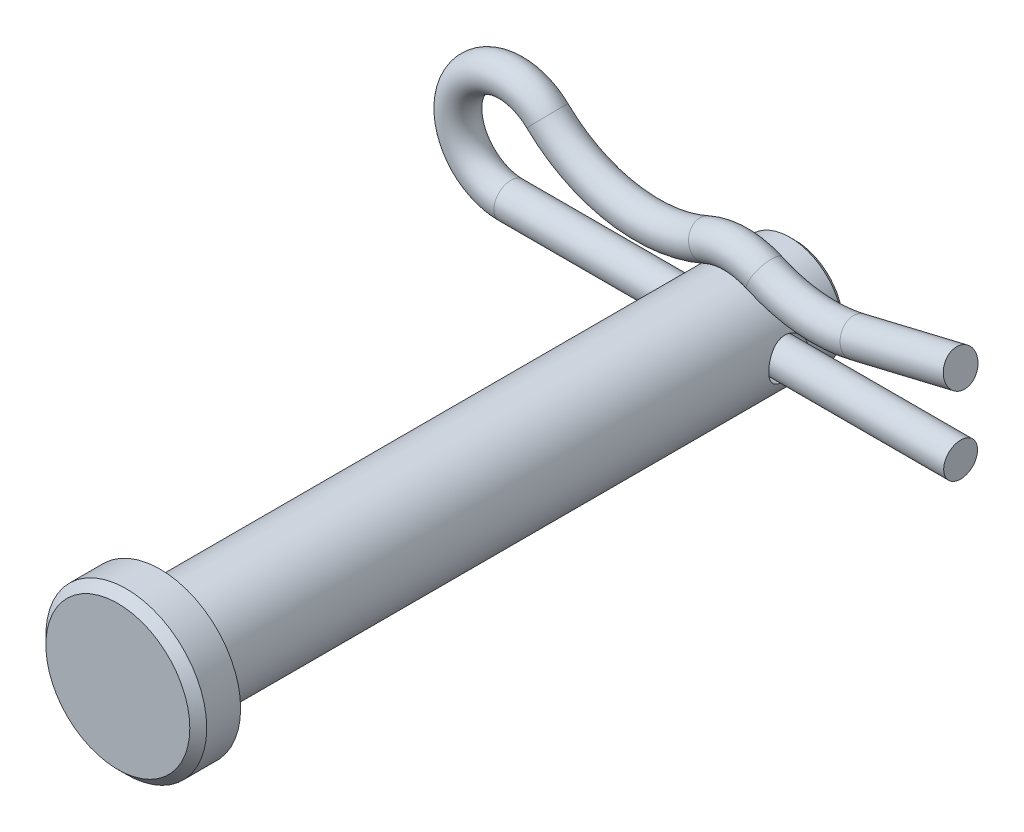
ISO-10303-21;
HEADER;
FILE_DESCRIPTION(('STEP AP214'),'2;1');
FILE_NAME('part.step','',(''),(''),'','','');
FILE_SCHEMA(('AUTOMOTIVE_DESIGN { 1 0 10303 214 1 1 1 1 }'));
ENDSEC;
DATA;
#1=APPLICATION_CONTEXT('core data for automotive mechanical design processes');
#2=APPLICATION_PROTOCOL_DEFINITION('international standard','automotive_design',2000,#1);
#3=PRODUCT_CONTEXT('',#1,'mechanical');
#4=PRODUCT('Part','Part','',(#3));
#5=PRODUCT_RELATED_PRODUCT_CATEGORY('part','',(#4));
#6=PRODUCT_DEFINITION_FORMATION('','',#4);
#7=PRODUCT_DEFINITION_CONTEXT('part definition',#1,'design');
#8=PRODUCT_DEFINITION('design','',#6,#7);
#9=PRODUCT_DEFINITION_SHAPE('','',#8);
#10=(LENGTH_UNIT() NAMED_UNIT(*) SI_UNIT(.MILLI.,.METRE.));
#11=(NAMED_UNIT(*) PLANE_ANGLE_UNIT() SI_UNIT($,.RADIAN.));
#12=(NAMED_UNIT(*) SI_UNIT($,.STERADIAN.) SOLID_ANGLE_UNIT());
#13=UNCERTAINTY_MEASURE_WITH_UNIT(LENGTH_MEASURE(1.E-05),#10,'distance_accuracy_value','');
#14=(GEOMETRIC_REPRESENTATION_CONTEXT(3) GLOBAL_UNCERTAINTY_ASSIGNED_CONTEXT((#13)) GLOBAL_UNIT_ASSIGNED_CONTEXT((#10,
#11,#12)) REPRESENTATION_CONTEXT('',''));
#15=CARTESIAN_POINT('',(0.,0.,0.));
#16=DIRECTION('',(0.,0.,1.));
#17=DIRECTION('',(1.,0.,0.));
#18=AXIS2_PLACEMENT_3D('',#15,#16,#17);
#19=CARTESIAN_POINT('',(7.30602677817418,3.28466385983467,-15.478125));
#20=DIRECTION('',(0.972644161927348,0.232300095283337,0.));
#21=DIRECTION('',(-0.232300095283337,0.972644161927348,0.));
#22=AXIS2_PLACEMENT_3D('',#19,#20,#21);
#23=CYLINDRICAL_SURFACE('',#22,1.016);
#24=CARTESIAN_POINT('',(7.30602677817418,3.28466385983467,-15.478125));
#25=DIRECTION('',(0.972644161927351,0.232300095283325,0.));
#26=DIRECTION('',(-0.232300095283325,0.972644161927351,0.));
#27=AXIS2_PLACEMENT_3D('',#24,#25,#26);
#28=CIRCLE('',#27,1.016);
#29=CARTESIAN_POINT('',(7.54204367498205,2.29645739131648,-15.478125));
#30=VERTEX_POINT('',#29);
#31=EDGE_CURVE('E44',#30,#30,#28,.T.);
#32=ORIENTED_EDGE('',*,*,#31,.T.);
#33=EDGE_LOOP('',(#32));
#34=FACE_BOUND('',#33,.T.);
#35=CARTESIAN_POINT('',(13.49375,4.76250000000001,-15.478125));
#36=DIRECTION('',(0.972644161927351,0.232300095283325,0.));
#37=DIRECTION('',(-0.232300095283325,0.972644161927351,0.));
#38=AXIS2_PLACEMENT_3D('',#35,#36,#37);
#39=CIRCLE('',#38,1.016);
#40=CARTESIAN_POINT('',(13.2577331031922,5.7507064685182,-15.478125));
#41=VERTEX_POINT('',#40);
#42=EDGE_CURVE('E11',#41,#41,#39,.T.);
#43=ORIENTED_EDGE('',*,*,#42,.F.);
#44=EDGE_LOOP('',(#43));
#45=FACE_BOUND('',#44,.T.);
#46=ADVANCED_FACE('F38',(#34,#45),#23,.T.);
#47=CARTESIAN_POINT('',(5.29632643400247,11.6993108904257,-15.478125));
#48=DIRECTION('',(0.,0.,1.));
#49=DIRECTION('',(1.,0.,0.));
#50=AXIS2_PLACEMENT_3D('',#47,#48,#49);
#51=TOROIDAL_SURFACE('',#50,8.65131089042575,1.016);
#52=CARTESIAN_POINT('',(1.72841977384718,3.8179897963947,-15.478125));
#53=DIRECTION('',(0.910997326746529,-0.412412258135811,0.));
#54=DIRECTION('',(0.412412258135811,0.910997326746529,0.));
#55=AXIS2_PLACEMENT_3D('',#52,#53,#54);
#56=CIRCLE('',#55,1.016);
#57=CARTESIAN_POINT('',(1.30940891958121,2.89241651242022,-15.478125));
#58=VERTEX_POINT('',#57);
#59=EDGE_CURVE('E48',#58,#58,#56,.T.);
#60=CARTESIAN_POINT('',(5.29632643400247,11.6993108904257,-15.478125));
#61=DIRECTION('',(0.,0.,1.));
#62=DIRECTION('',(1.,0.,0.));
#63=AXIS2_PLACEMENT_3D('',#60,#61,#62);
#64=CIRCLE('',#63,9.66731089042575);
#65=EDGE_CURVE('',#58,#30,#64,.T.);
#66=ORIENTED_EDGE('',*,*,#59,.T.);
#67=ORIENTED_EDGE('',*,*,#31,.F.);
#68=ORIENTED_EDGE('',*,*,#65,.T.);
#69=ORIENTED_EDGE('',*,*,#65,.F.);
#70=EDGE_LOOP('',(#66,#68,#67,#69));
#71=FACE_BOUND('',#70,.T.);
#72=ADVANCED_FACE('F85',(#71),#51,.T.);
#73=CARTESIAN_POINT('',(0.,0.,-15.478125));
#74=DIRECTION('',(0.,0.,-1.));
#75=DIRECTION('',(-1.,0.,0.));
#76=AXIS2_PLACEMENT_3D('',#73,#74,#75);
#77=TOROIDAL_SURFACE('',#76,4.191,1.016);
#78=CARTESIAN_POINT('',(-1.7284197738471,3.81798979639474,-15.478125));
#79=DIRECTION('',(0.910997326746538,0.412412258135789,0.));
#80=DIRECTION('',(-0.412412258135789,0.910997326746538,0.));
#81=AXIS2_PLACEMENT_3D('',#78,#79,#80);
#82=CIRCLE('',#81,1.016);
#83=CARTESIAN_POINT('',(-1.30940891958112,2.89241651242027,-15.478125));
#84=VERTEX_POINT('',#83);
#85=EDGE_CURVE('E52',#84,#84,#82,.T.);
#86=ORIENTED_EDGE('',*,*,#85,.T.);
#87=EDGE_LOOP('',(#86));
#88=FACE_BOUND('',#87,.T.);
#89=ORIENTED_EDGE('',*,*,#59,.F.);
#90=EDGE_LOOP('',(#89));
#91=FACE_BOUND('',#90,.T.);
#92=ADVANCED_FACE('F89',(#88,#91),#77,.T.);
#93=CARTESIAN_POINT('',(-5.29632643400247,11.6993108904257,-15.478125));
#94=DIRECTION('',(0.,0.,1.));
#95=DIRECTION('',(1.,0.,0.));
#96=AXIS2_PLACEMENT_3D('',#93,#94,#95);
#97=TOROIDAL_SURFACE('',#96,8.65131089042574,1.016);
#98=CARTESIAN_POINT('',(-11.2929944082361,5.46351476405987,-15.478125));
#99=DIRECTION('',(0.720792051672401,-0.693151367484686,0.));
#100=DIRECTION('',(0.693151367484686,0.720792051672401,0.));
#101=AXIS2_PLACEMENT_3D('',#98,#99,#100);
#102=CIRCLE('',#101,1.016);
#103=CARTESIAN_POINT('',(-11.9972361976005,4.7311900395607,-15.478125));
#104=VERTEX_POINT('',#103);
#105=EDGE_CURVE('E57',#104,#104,#102,.T.);
#106=CARTESIAN_POINT('',(-5.29632643400247,11.6993108904257,-15.478125));
#107=DIRECTION('',(0.,0.,1.));
#108=DIRECTION('',(1.,0.,0.));
#109=AXIS2_PLACEMENT_3D('',#106,#107,#108);
#110=CIRCLE('',#109,9.66731089042575);
#111=EDGE_CURVE('',#104,#84,#110,.T.);
#112=ORIENTED_EDGE('',*,*,#105,.T.);
#113=ORIENTED_EDGE('',*,*,#85,.F.);
#114=ORIENTED_EDGE('',*,*,#111,.T.);
#115=ORIENTED_EDGE('',*,*,#111,.F.);
#116=EDGE_LOOP('',(#112,#114,#113,#115));
#117=FACE_BOUND('',#116,.T.);
#118=ADVANCED_FACE('F95',(#117),#97,.T.);
#119=CARTESIAN_POINT('',(-13.49375,3.175,-15.478125));
#120=DIRECTION('',(0.,0.,-1.));
#121=DIRECTION('',(-1.,0.,0.));
#122=AXIS2_PLACEMENT_3D('',#119,#120,#121);
#123=TOROIDAL_SURFACE('',#122,3.175,1.016);
#124=CARTESIAN_POINT('',(-13.49375,0.,-15.478125));
#125=DIRECTION('',(-1.,0.,0.));
#126=DIRECTION('',(0.,-1.,0.));
#127=AXIS2_PLACEMENT_3D('',#124,#125,#126);
#128=CIRCLE('',#127,1.016);
#129=CARTESIAN_POINT('',(-13.49375,-1.016,-15.478125));
#130=VERTEX_POINT('',#129);
#131=EDGE_CURVE('E60',#130,#130,#128,.T.);
#132=ORIENTED_EDGE('',*,*,#131,.T.);
#133=EDGE_LOOP('',(#132));
#134=FACE_BOUND('',#133,.T.);
#135=ORIENTED_EDGE('',*,*,#105,.F.);
#136=EDGE_LOOP('',(#135));
#137=FACE_BOUND('',#136,.T.);
#138=ADVANCED_FACE('F67',(#134,#137),#123,.T.);
#139=CARTESIAN_POINT('',(-13.49375,0.,-15.478125));
#140=DIRECTION('',(1.,0.,0.));
#141=DIRECTION('',(0.,0.,-1.));
#142=AXIS2_PLACEMENT_3D('',#139,#140,#141);
#143=CYLINDRICAL_SURFACE('',#142,1.016);
#144=ORIENTED_EDGE('',*,*,#131,.F.);
#145=EDGE_LOOP('',(#144));
#146=FACE_BOUND('',#145,.T.);
#147=CARTESIAN_POINT('',(13.49375,0.,-15.478125));
#148=DIRECTION('',(-1.,0.,0.));
#149=DIRECTION('',(0.,-1.,0.));
#150=AXIS2_PLACEMENT_3D('',#147,#148,#149);
#151=CIRCLE('',#150,1.016);
#152=CARTESIAN_POINT('',(13.49375,-1.016,-15.478125));
#153=VERTEX_POINT('',#152);
#154=EDGE_CURVE('E61',#153,#153,#151,.T.);
#155=ORIENTED_EDGE('',*,*,#154,.T.);
#156=EDGE_LOOP('',(#155));
#157=FACE_BOUND('',#156,.T.);
#158=ADVANCED_FACE('F70',(#146,#157),#143,.T.);
#159=CARTESIAN_POINT('',(13.49375,4.76250000000001,-15.478125));
#160=DIRECTION('',(0.972644161927351,0.232300095283325,0.));
#161=DIRECTION('',(-0.232300095283325,0.972644161927351,0.));
#162=AXIS2_PLACEMENT_3D('',#159,#160,#161);
#163=PLANE('',#162);
#164=ORIENTED_EDGE('',*,*,#42,.T.);
#165=EDGE_LOOP('',(#164));
#166=FACE_BOUND('',#165,.T.);
#167=ADVANCED_FACE('F73',(#166),#163,.T.);
#168=CARTESIAN_POINT('',(13.49375,0.,-15.478125));
#169=DIRECTION('',(-1.,0.,0.));
#170=DIRECTION('',(0.,-1.,0.));
#171=AXIS2_PLACEMENT_3D('',#168,#169,#170);
#172=PLANE('',#171);
#173=ORIENTED_EDGE('',*,*,#154,.F.);
#174=EDGE_LOOP('',(#173));
#175=FACE_BOUND('',#174,.T.);
#176=ADVANCED_FACE('F77',(#175),#172,.F.);
#177=CLOSED_SHELL('',(#46,#72,#92,#118,#138,#158,#167,#176));
#178=MANIFOLD_SOLID_BREP('B2',#177);
#179=CARTESIAN_POINT('',(0.,0.,19.05));
#180=DIRECTION('',(0.,0.,-1.));
#181=DIRECTION('',(-1.,0.,0.));
#182=AXIS2_PLACEMENT_3D('',#179,#180,#181);
#183=CYLINDRICAL_SURFACE('',#182,3.175);
#184=CARTESIAN_POINT('',(0.,0.,-18.7324999999999));
#185=DIRECTION('',(0.,0.,1.));
#186=DIRECTION('',(1.,0.,0.));
#187=AXIS2_PLACEMENT_3D('',#184,#185,#186);
#188=CIRCLE('',#187,3.175);
#189=CARTESIAN_POINT('',(3.175,0.,-18.7324999999999));
#190=VERTEX_POINT('',#189);
#191=EDGE_CURVE('E160',#190,#190,#188,.T.);
#192=ORIENTED_EDGE('',*,*,#191,.T.);
#193=EDGE_LOOP('',(#192));
#194=FACE_BOUND('',#193,.T.);
#195=CARTESIAN_POINT('',(-3.175,0.,-14.2875));
#196=CARTESIAN_POINT('',(-3.1750017260582,-0.0644803280319205,-14.2874976962969));
#197=CARTESIAN_POINT('',(-3.17301863556027,-0.128944879414297,-14.2927544346972));
#198=CARTESIAN_POINT('',(-3.16530589955499,-0.255947427804686,-14.3135573799955));
#199=CARTESIAN_POINT('',(-3.15957679372107,-0.31848570096517,-14.3291021047485));
#200=CARTESIAN_POINT('',(-3.14498698210789,-0.439785748086509,-14.3698539451563));
#201=CARTESIAN_POINT('',(-3.13613231952368,-0.498554552928806,-14.3950424227273));
#202=CARTESIAN_POINT('',(-3.11617334413749,-0.6110282024397,-14.4542719653313));
#203=CARTESIAN_POINT('',(-3.10506842811866,-0.66473168359744,-14.4883154047757));
#204=CARTESIAN_POINT('',(-3.08122833533403,-0.767831218530123,-14.5657986965375));
#205=CARTESIAN_POINT('',(-3.06844702050705,-0.816983642057507,-14.6095483956684));
#206=CARTESIAN_POINT('',(-3.04292175316616,-0.907450095452756,-14.7045445325105));
#207=CARTESIAN_POINT('',(-3.03017781325932,-0.94876172610117,-14.7557932563948));
#208=CARTESIAN_POINT('',(-3.00563336052824,-1.02392323008938,-14.8667132398465));
#209=CARTESIAN_POINT('',(-2.99388727501525,-1.05742893349134,-14.9266309659457));
#210=CARTESIAN_POINT('',(-2.97338639063463,-1.11377925527679,-15.0517608811213));
#211=CARTESIAN_POINT('',(-2.96463039737106,-1.13662813187983,-15.1169709432544));
#212=CARTESIAN_POINT('',(-2.95159440179158,-1.1700544212018,-15.2480301625799));
#213=CARTESIAN_POINT('',(-2.94714552453477,-1.1810967711723,-15.3137433742581));
#214=CARTESIAN_POINT('',(-2.94273336284839,-1.19205022996995,-15.4462290754076));
#215=CARTESIAN_POINT('',(-2.94276822592073,-1.19196593587088,-15.5130011160129));
#216=CARTESIAN_POINT('',(-2.94717399857943,-1.18102403502952,-15.6414545606378));
#217=CARTESIAN_POINT('',(-2.95128528416453,-1.17081148004021,-15.7032014691726));
#218=CARTESIAN_POINT('',(-2.96294919584751,-1.14096933245487,-15.8240310506342));
#219=CARTESIAN_POINT('',(-2.97050234018473,-1.12133832170211,-15.8831133208748));
#220=CARTESIAN_POINT('',(-2.98835526113513,-1.07286225428949,-15.9982511725093));
#221=CARTESIAN_POINT('',(-2.99870429903107,-1.04384989935074,-16.0542283421088));
#222=CARTESIAN_POINT('',(-3.02096654298085,-0.977551335491413,-16.1607069292128));
#223=CARTESIAN_POINT('',(-3.03288028850369,-0.940262269910617,-16.2112064471563));
#224=CARTESIAN_POINT('',(-3.05790630844421,-0.855517884834481,-16.3088666580229));
#225=CARTESIAN_POINT('',(-3.07104532042939,-0.807547746065835,-16.3555748585938));
#226=CARTESIAN_POINT('',(-3.09635309230243,-0.704304368962598,-16.4404182606759));
#227=CARTESIAN_POINT('',(-3.10852170288599,-0.649030010276033,-16.4785521445933));
#228=CARTESIAN_POINT('',(-3.13075950879707,-0.531592978112733,-16.5456635026684));
#229=CARTESIAN_POINT('',(-3.1407933299357,-0.469337004114246,-16.5744902675942));
#230=CARTESIAN_POINT('',(-3.15736857672026,-0.340389250103889,-16.6211111921393));
#231=CARTESIAN_POINT('',(-3.1639115533356,-0.273699454858828,-16.6389102518954));
#232=CARTESIAN_POINT('',(-3.17249526812277,-0.141585349249253,-16.6621005876114));
#233=CARTESIAN_POINT('',(-3.17475686664138,-0.0762822480275041,-16.6681011938161));
#234=CARTESIAN_POINT('',(-3.17520553124475,0.0544294022336749,-16.6692985319706));
#235=CARTESIAN_POINT('',(-3.17339350069573,0.119837924680551,-16.6644976592514));
#236=CARTESIAN_POINT('',(-3.16604419632036,0.246270501045975,-16.6446914039175));
#237=CARTESIAN_POINT('',(-3.1606527382633,0.307366454105822,-16.6300852121587));
#238=CARTESIAN_POINT('',(-3.14683359941551,0.426197517997293,-16.5916085549156));
#239=CARTESIAN_POINT('',(-3.13840552373861,0.483932190588355,-16.5677368845037));
#240=CARTESIAN_POINT('',(-3.11903764373597,0.596302913556185,-16.5106457851262));
#241=CARTESIAN_POINT('',(-3.1080313141617,0.650798072573999,-16.4771723024289));
#242=CARTESIAN_POINT('',(-3.08472420554452,0.753580464933008,-16.4021150056076));
#243=CARTESIAN_POINT('',(-3.07242294938803,0.80186539546467,-16.3605281972923));
#244=CARTESIAN_POINT('',(-3.04699455283473,0.893786946503481,-16.2675854780639));
#245=CARTESIAN_POINT('',(-3.03386090349835,0.936991348355825,-16.2158027674242));
#246=CARTESIAN_POINT('',(-3.00893809999065,1.01418270962823,-16.1054642133883));
#247=CARTESIAN_POINT('',(-2.99714906660554,1.04816884135274,-16.0469077624604));
#248=CARTESIAN_POINT('',(-2.9762992117158,1.10599357730704,-15.9241998104995));
#249=CARTESIAN_POINT('',(-2.96724991010742,1.12978950323491,-15.8600261079336));
#250=CARTESIAN_POINT('',(-2.95317888607235,1.16608132501843,-15.7281485000728));
#251=CARTESIAN_POINT('',(-2.94815467214383,1.17858421180018,-15.6604468062677));
#252=CARTESIAN_POINT('',(-2.94303366491605,1.1913103800891,-15.5281184233642));
#253=CARTESIAN_POINT('',(-2.94264115340402,1.19227069374821,-15.4635734735747));
#254=CARTESIAN_POINT('',(-2.94606990116576,1.18377268040514,-15.3352934052058));
#255=CARTESIAN_POINT('',(-2.94989076088501,1.17431534131035,-15.2715582104169));
#256=CARTESIAN_POINT('',(-2.96106962383437,1.14582428656504,-15.1486812637937));
#257=CARTESIAN_POINT('',(-2.96831611517726,1.12709164913741,-15.0894586876678));
#258=CARTESIAN_POINT('',(-2.98546478961414,1.08084696819061,-14.9749625026326));
#259=CARTESIAN_POINT('',(-2.99536764396202,1.0533327052505,-14.9196898963443));
#260=CARTESIAN_POINT('',(-3.01735905848772,0.988632102759095,-14.8115124856775));
#261=CARTESIAN_POINT('',(-3.02953498137515,0.951014360373893,-14.7588836800401));
#262=CARTESIAN_POINT('',(-3.0543995836351,0.867842480481128,-14.6604501359791));
#263=CARTESIAN_POINT('',(-3.06708842498621,0.822285820601665,-14.614647575013));
#264=CARTESIAN_POINT('',(-3.09237399534093,0.721582564947794,-14.5286396975664));
#265=CARTESIAN_POINT('',(-3.10492858264887,0.666050423844063,-14.4888713957112));
#266=CARTESIAN_POINT('',(-3.12780770850268,0.548650495915652,-14.4192445173742));
#267=CARTESIAN_POINT('',(-3.13813207344675,0.48678221643443,-14.3893867122343));
#268=CARTESIAN_POINT('',(-3.15574594756552,0.355599271339335,-14.3395883919429));
#269=CARTESIAN_POINT('',(-3.16288465369445,0.286078153898403,-14.3201333924722));
#270=CARTESIAN_POINT('',(-3.17250954730047,0.144363863550066,-14.294093713063));
#271=CARTESIAN_POINT('',(-3.17499806804399,0.0721720492396068,-14.2875025785069));
#272=CARTESIAN_POINT('',(-3.175,0.,-14.2875));
#273=B_SPLINE_CURVE_WITH_KNOTS('',3,(#195,#196,#197,#198,#199,#200,#201,#202,#203,#204,#205,
#206,#207,#208,#209,#210,#211,#212,#213,#214,#215,#216,#217,#218,#219,#220,#221,#222,#223,#224,
#225,#226,#227,#228,#229,#230,#231,#232,#233,#234,#235,#236,#237,#238,#239,#240,#241,#242,#243,
#244,#245,#246,#247,#248,#249,#250,#251,#252,#253,#254,#255,#256,#257,#258,#259,#260,#261,#262,
#263,#264,#265,#266,#267,#268,#269,#270,#271,#272),.UNSPECIFIED.,.T.,.F.,(4,2,2,2,2,2,2,2,2,2,2,
2,2,2,2,2,2,2,2,2,2,2,2,2,2,2,2,2,2,2,2,2,2,2,2,2,2,2,4),(0.,0.193174779988694,
0.386321736189803,0.579097274313272,0.771924557565031,0.972134347500303,1.17240530159712,
1.38030485385691,1.58812126298256,1.78741287818415,1.98662215450767,2.17390936438977,
2.36122478335592,2.55208411657195,2.74300942653255,2.94676634210301,3.15055454712146,
3.35749404133322,3.56434151635959,3.76019234336016,3.95599974284975,4.14428335102048,
4.33259145270722,4.52643257351057,4.7203453664077,4.92550862317928,5.13069029517862,
5.33672309214718,5.54262825746727,5.7353101851245,5.92797384230186,6.1147574430106,
6.30158828783601,6.4982127455814,6.69489978960167,6.90223036662893,7.10957707657799,
7.32590383806683,7.54212202675676),.UNSPECIFIED.);
#274=CARTESIAN_POINT('',(-3.175,0.,-14.2875));
#275=VERTEX_POINT('',#274);
#276=EDGE_CURVE('E171',#275,#275,#273,.T.);
#277=ORIENTED_EDGE('',*,*,#276,.T.);
#278=EDGE_LOOP('',(#277));
#279=FACE_BOUND('',#278,.T.);
#280=CARTESIAN_POINT('',(3.175,0.,-16.66875));
#281=CARTESIAN_POINT('',(3.1750017260582,-0.0644803280319206,-16.6687523037031));
#282=CARTESIAN_POINT('',(3.17301863556027,-0.128944879414297,-16.6634955653028));
#283=CARTESIAN_POINT('',(3.16530589955499,-0.255947427804686,-16.6426926200045));
#284=CARTESIAN_POINT('',(3.15957679372107,-0.31848570096517,-16.6271478952515));
#285=CARTESIAN_POINT('',(3.14498698210789,-0.43978574808651,-16.5863960548437));
#286=CARTESIAN_POINT('',(3.13613231952368,-0.498554552928809,-16.5612075772727));
#287=CARTESIAN_POINT('',(3.11617334413749,-0.611028202439702,-16.5019780346687));
#288=CARTESIAN_POINT('',(3.10506842811866,-0.664731683597442,-16.4679345952243));
#289=CARTESIAN_POINT('',(3.08122833533403,-0.767831218530124,-16.3904513034625));
#290=CARTESIAN_POINT('',(3.06844702050705,-0.816983642057508,-16.3467016043316));
#291=CARTESIAN_POINT('',(3.04292175316616,-0.907450095452757,-16.2517054674895));
#292=CARTESIAN_POINT('',(3.03017781325932,-0.948761726101171,-16.2004567436052));
#293=CARTESIAN_POINT('',(3.00563336052824,-1.02392323008938,-16.0895367601535));
#294=CARTESIAN_POINT('',(2.99388727501525,-1.05742893349134,-16.0296190340543));
#295=CARTESIAN_POINT('',(2.97338639063463,-1.11377925527679,-15.9044891188787));
#296=CARTESIAN_POINT('',(2.96463039737106,-1.13662813187984,-15.8392790567456));
#297=CARTESIAN_POINT('',(2.95159440179158,-1.1700544212018,-15.7082198374201));
#298=CARTESIAN_POINT('',(2.94714552453477,-1.1810967711723,-15.6425066257419));
#299=CARTESIAN_POINT('',(2.94273336284839,-1.19205022996995,-15.5100209245924));
#300=CARTESIAN_POINT('',(2.94276822592073,-1.19196593587088,-15.4432488839871));
#301=CARTESIAN_POINT('',(2.94717399857943,-1.18102403502952,-15.3147954393622));
#302=CARTESIAN_POINT('',(2.95128528416453,-1.17081148004021,-15.2530485308274));
#303=CARTESIAN_POINT('',(2.96294919584751,-1.14096933245487,-15.1322189493658));
#304=CARTESIAN_POINT('',(2.97050234018473,-1.12133832170211,-15.0731366791252));
#305=CARTESIAN_POINT('',(2.98835526113513,-1.07286225428949,-14.9579988274907));
#306=CARTESIAN_POINT('',(2.99870429903107,-1.04384989935074,-14.9020216578912));
#307=CARTESIAN_POINT('',(3.02096654298085,-0.977551335491412,-14.7955430707872));
#308=CARTESIAN_POINT('',(3.03288028850369,-0.940262269910615,-14.7450435528437));
#309=CARTESIAN_POINT('',(3.05790630844421,-0.85551788483448,-14.6473833419771));
#310=CARTESIAN_POINT('',(3.07104532042939,-0.807547746065834,-14.6006751414062));
#311=CARTESIAN_POINT('',(3.09635309230243,-0.704304368962597,-14.5158317393242));
#312=CARTESIAN_POINT('',(3.10852170288599,-0.649030010276032,-14.4776978554068));
#313=CARTESIAN_POINT('',(3.13075950879707,-0.531592978112732,-14.4105864973316));
#314=CARTESIAN_POINT('',(3.1407933299357,-0.469337004114245,-14.3817597324058));
#315=CARTESIAN_POINT('',(3.15736857672026,-0.340389250103886,-14.3351388078607));
#316=CARTESIAN_POINT('',(3.1639115533356,-0.273699454858826,-14.3173397481046));
#317=CARTESIAN_POINT('',(3.17249526812277,-0.141585349249251,-14.2941494123886));
#318=CARTESIAN_POINT('',(3.17475686664138,-0.0762822480275016,-14.2881488061839));
#319=CARTESIAN_POINT('',(3.17520553124475,0.0544294022336771,-14.2869514680294));
#320=CARTESIAN_POINT('',(3.17339350069573,0.119837924680553,-14.2917523407486));
#321=CARTESIAN_POINT('',(3.16604419632035,0.246270501045977,-14.3115585960825));
#322=CARTESIAN_POINT('',(3.16065273826329,0.307366454105824,-14.3261647878413));
#323=CARTESIAN_POINT('',(3.1468335994155,0.426197517997295,-14.3646414450844));
#324=CARTESIAN_POINT('',(3.13840552373861,0.483932190588356,-14.3885131154963));
#325=CARTESIAN_POINT('',(3.11903764373597,0.596302913556186,-14.4456042148738));
#326=CARTESIAN_POINT('',(3.1080313141617,0.650798072574,-14.4790776975711));
#327=CARTESIAN_POINT('',(3.08472420554452,0.753580464933009,-14.5541349943924));
#328=CARTESIAN_POINT('',(3.07242294938803,0.801865395464671,-14.5957218027077));
#329=CARTESIAN_POINT('',(3.04699455283473,0.893786946503481,-14.6886645219361));
#330=CARTESIAN_POINT('',(3.03386090349835,0.936991348355825,-14.7404472325758));
#331=CARTESIAN_POINT('',(3.00893809999065,1.01418270962823,-14.8507857866117));
#332=CARTESIAN_POINT('',(2.99714906660554,1.04816884135274,-14.9093422375396));
#333=CARTESIAN_POINT('',(2.9762992117158,1.10599357730704,-15.0320501895005));
#334=CARTESIAN_POINT('',(2.96724991010742,1.12978950323491,-15.0962238920664));
#335=CARTESIAN_POINT('',(2.95317888607235,1.16608132501843,-15.2281014999272));
#336=CARTESIAN_POINT('',(2.94815467214383,1.17858421180018,-15.2958031937323));
#337=CARTESIAN_POINT('',(2.94303366491605,1.1913103800891,-15.4281315766358));
#338=CARTESIAN_POINT('',(2.94264115340402,1.19227069374821,-15.4926765264253));
#339=CARTESIAN_POINT('',(2.94606990116576,1.18377268040514,-15.6209565947942));
#340=CARTESIAN_POINT('',(2.94989076088501,1.17431534131035,-15.6846917895831));
#341=CARTESIAN_POINT('',(2.96106962383437,1.14582428656504,-15.8075687362063));
#342=CARTESIAN_POINT('',(2.96831611517726,1.12709164913741,-15.8667913123322));
#343=CARTESIAN_POINT('',(2.98546478961414,1.08084696819061,-15.9812874973674));
#344=CARTESIAN_POINT('',(2.99536764396202,1.0533327052505,-16.0365601036557));
#345=CARTESIAN_POINT('',(3.01735905848772,0.988632102759095,-16.1447375143225));
#346=CARTESIAN_POINT('',(3.02953498137515,0.951014360373894,-16.1973663199599));
#347=CARTESIAN_POINT('',(3.05439958363509,0.86784248048113,-16.2957998640209));
#348=CARTESIAN_POINT('',(3.06708842498621,0.822285820601665,-16.341602424987));
#349=CARTESIAN_POINT('',(3.09237399534093,0.721582564947793,-16.4276103024336));
#350=CARTESIAN_POINT('',(3.10492858264887,0.666050423844061,-16.4673786042888));
#351=CARTESIAN_POINT('',(3.12780770850268,0.54865049591565,-16.5370054826258));
#352=CARTESIAN_POINT('',(3.13813207344675,0.486782216434429,-16.5668632877657));
#353=CARTESIAN_POINT('',(3.15574594756552,0.355599271339333,-16.6166616080571));
#354=CARTESIAN_POINT('',(3.16288465369445,0.286078153898401,-16.6361166075278));
#355=CARTESIAN_POINT('',(3.17250954730047,0.144363863550064,-16.662156286937));
#356=CARTESIAN_POINT('',(3.17499806804399,0.0721720492396062,-16.6687474214931));
#357=CARTESIAN_POINT('',(3.175,0.,-16.66875));
#358=B_SPLINE_CURVE_WITH_KNOTS('',3,(#280,#281,#282,#283,#284,#285,#286,#287,#288,#289,#290,
#291,#292,#293,#294,#295,#296,#297,#298,#299,#300,#301,#302,#303,#304,#305,#306,#307,#308,#309,
#310,#311,#312,#313,#314,#315,#316,#317,#318,#319,#320,#321,#322,#323,#324,#325,#326,#327,#328,
#329,#330,#331,#332,#333,#334,#335,#336,#337,#338,#339,#340,#341,#342,#343,#344,#345,#346,#347,
#348,#349,#350,#351,#352,#353,#354,#355,#356,#357),.UNSPECIFIED.,.T.,.F.,(4,2,2,2,2,2,2,2,2,2,2,
2,2,2,2,2,2,2,2,2,2,2,2,2,2,2,2,2,2,2,2,2,2,2,2,2,2,2,4),(0.,0.193174779988694,
0.386321736189804,0.579097274313274,0.771924557565034,0.972134347500303,1.17240530159712,
1.38030485385692,1.58812126298256,1.78741287818416,1.98662215450768,2.17390936438977,
2.36122478335592,2.55208411657196,2.74300942653255,2.94676634210301,3.15055454712146,
3.35749404133322,3.56434151635959,3.76019234336016,3.95599974284976,4.14428335102048,
4.33259145270722,4.52643257351057,4.7203453664077,4.92550862317928,5.13069029517862,
5.33672309214718,5.54262825746727,5.7353101851245,5.92797384230187,6.11475744301061,
6.30158828783601,6.4982127455814,6.69489978960167,6.90223036662893,7.10957707657799,
7.32590383806683,7.54212202675676),.UNSPECIFIED.);
#359=CARTESIAN_POINT('',(3.175,0.,-16.66875));
#360=VERTEX_POINT('',#359);
#361=EDGE_CURVE('E179',#360,#360,#358,.T.);
#362=ORIENTED_EDGE('',*,*,#361,.T.);
#363=EDGE_LOOP('',(#362));
#364=FACE_BOUND('',#363,.T.);
#365=CARTESIAN_POINT('',(0.,0.,19.05));
#366=DIRECTION('',(0.,0.,1.));
#367=DIRECTION('',(1.,0.,0.));
#368=AXIS2_PLACEMENT_3D('',#365,#366,#367);
#369=CIRCLE('',#368,3.175);
#370=CARTESIAN_POINT('',(3.175,0.,19.05));
#371=VERTEX_POINT('',#370);
#372=EDGE_CURVE('E217',#371,#371,#369,.T.);
#373=ORIENTED_EDGE('',*,*,#372,.F.);
#374=EDGE_LOOP('',(#373));
#375=FACE_BOUND('',#374,.T.);
#376=ADVANCED_FACE('F153',(#194,#279,#364,#375),#183,.T.);
#377=CARTESIAN_POINT('',(0.,0.,-19.05));
#378=DIRECTION('',(0.,0.,1.));
#379=DIRECTION('',(1.,0.,0.));
#380=AXIS2_PLACEMENT_3D('',#377,#378,#379);
#381=PLANE('',#380);
#382=CARTESIAN_POINT('',(0.,0.,-19.05));
#383=DIRECTION('',(0.,0.,1.));
#384=DIRECTION('',(1.,0.,0.));
#385=AXIS2_PLACEMENT_3D('',#382,#383,#384);
#386=CIRCLE('',#385,2.85749999999996);
#387=CARTESIAN_POINT('',(2.85749999999996,0.,-19.05));
#388=VERTEX_POINT('',#387);
#389=EDGE_CURVE('E37',#388,#388,#386,.F.);
#390=ORIENTED_EDGE('',*,*,#389,.T.);
#391=EDGE_LOOP('',(#390));
#392=FACE_BOUND('',#391,.T.);
#393=ADVANCED_FACE('F199',(#392),#381,.F.);
#394=CARTESIAN_POINT('',(0.,0.,19.05));
#395=DIRECTION('',(0.,0.,1.));
#396=DIRECTION('',(1.,0.,0.));
#397=AXIS2_PLACEMENT_3D('',#394,#395,#396);
#398=PLANE('',#397);
#399=CARTESIAN_POINT('',(0.,0.,19.05));
#400=DIRECTION('',(0.,0.,1.));
#401=DIRECTION('',(1.,0.,0.));
#402=AXIS2_PLACEMENT_3D('',#399,#400,#401);
#403=CIRCLE('',#402,4.826);
#404=CARTESIAN_POINT('',(4.826,0.,19.05));
#405=VERTEX_POINT('',#404);
#406=EDGE_CURVE('E178',#405,#405,#403,.T.);
#407=ORIENTED_EDGE('',*,*,#406,.F.);
#408=EDGE_LOOP('',(#407));
#409=FACE_BOUND('',#408,.T.);
#410=ORIENTED_EDGE('',*,*,#372,.T.);
#411=EDGE_LOOP('',(#410));
#412=FACE_BOUND('',#411,.T.);
#413=ADVANCED_FACE('F196',(#409,#412),#398,.F.);
#414=CARTESIAN_POINT('',(0.,0.,21.59));
#415=DIRECTION('',(0.,0.,-1.));
#416=DIRECTION('',(-1.,0.,0.));
#417=AXIS2_PLACEMENT_3D('',#414,#415,#416);
#418=CYLINDRICAL_SURFACE('',#417,4.826);
#419=CARTESIAN_POINT('',(0.,0.,21.082));
#420=DIRECTION('',(0.,0.,1.));
#421=DIRECTION('',(1.,0.,0.));
#422=AXIS2_PLACEMENT_3D('',#419,#420,#421);
#423=CIRCLE('',#422,4.826);
#424=CARTESIAN_POINT('',(4.826,0.,21.082));
#425=VERTEX_POINT('',#424);
#426=EDGE_CURVE('E164',#425,#425,#423,.F.);
#427=ORIENTED_EDGE('',*,*,#426,.T.);
#428=EDGE_LOOP('',(#427));
#429=FACE_BOUND('',#428,.T.);
#430=ORIENTED_EDGE('',*,*,#406,.T.);
#431=EDGE_LOOP('',(#430));
#432=FACE_BOUND('',#431,.T.);
#433=ADVANCED_FACE('F194',(#429,#432),#418,.T.);
#434=CARTESIAN_POINT('',(0.,0.,21.59));
#435=DIRECTION('',(0.,0.,1.));
#436=DIRECTION('',(1.,0.,0.));
#437=AXIS2_PLACEMENT_3D('',#434,#435,#436);
#438=PLANE('',#437);
#439=CARTESIAN_POINT('',(0.,0.,21.59));
#440=DIRECTION('',(0.,0.,1.));
#441=DIRECTION('',(1.,0.,0.));
#442=AXIS2_PLACEMENT_3D('',#439,#440,#441);
#443=CIRCLE('',#442,4.318);
#444=CARTESIAN_POINT('',(4.318,0.,21.59));
#445=VERTEX_POINT('',#444);
#446=EDGE_CURVE('E168',#445,#445,#443,.T.);
#447=ORIENTED_EDGE('',*,*,#446,.T.);
#448=EDGE_LOOP('',(#447));
#449=FACE_BOUND('',#448,.T.);
#450=ADVANCED_FACE('F190',(#449),#438,.T.);
#451=CARTESIAN_POINT('',(0.,0.,21.59));
#452=DIRECTION('',(0.,0.,-1.));
#453=DIRECTION('',(-1.,0.,0.));
#454=AXIS2_PLACEMENT_3D('',#451,#452,#453);
#455=CONICAL_SURFACE('',#454,4.318,0.785398163397451);
#456=ORIENTED_EDGE('',*,*,#426,.F.);
#457=EDGE_LOOP('',(#456));
#458=FACE_BOUND('',#457,.T.);
#459=ORIENTED_EDGE('',*,*,#446,.F.);
#460=EDGE_LOOP('',(#459));
#461=FACE_BOUND('',#460,.T.);
#462=ADVANCED_FACE('F188',(#458,#461),#455,.T.);
#463=CARTESIAN_POINT('',(-4.826,0.,-15.478125));
#464=DIRECTION('',(1.,0.,0.));
#465=DIRECTION('',(0.,0.,-1.));
#466=AXIS2_PLACEMENT_3D('',#463,#464,#465);
#467=CYLINDRICAL_SURFACE('',#466,1.190625);
#468=ORIENTED_EDGE('',*,*,#361,.F.);
#469=EDGE_LOOP('',(#468));
#470=FACE_BOUND('',#469,.T.);
#471=ORIENTED_EDGE('',*,*,#276,.F.);
#472=EDGE_LOOP('',(#471));
#473=FACE_BOUND('',#472,.T.);
#474=ADVANCED_FACE('F184',(#470,#473),#467,.F.);
#475=CARTESIAN_POINT('',(0.,0.,-18.7325));
#476=DIRECTION('',(0.,0.,1.));
#477=DIRECTION('',(1.,0.,0.));
#478=AXIS2_PLACEMENT_3D('',#475,#476,#477);
#479=CONICAL_SURFACE('',#478,3.175,0.785398163397442);
#480=ORIENTED_EDGE('',*,*,#389,.F.);
#481=EDGE_LOOP('',(#480));
#482=FACE_BOUND('',#481,.T.);
#483=ORIENTED_EDGE('',*,*,#191,.F.);
#484=EDGE_LOOP('',(#483));
#485=FACE_BOUND('',#484,.T.);
#486=ADVANCED_FACE('F155',(#482,#485),#479,.T.);
#487=CLOSED_SHELL('',(#376,#393,#413,#433,#450,#462,#474,#486));
#488=MANIFOLD_SOLID_BREP('B6',#487);
#489=ADVANCED_BREP_SHAPE_REPRESENTATION('',(#18,#178,#488),#14);
#490=SHAPE_DEFINITION_REPRESENTATION(#9,#489);
ENDSEC;
END-ISO-10303-21;
